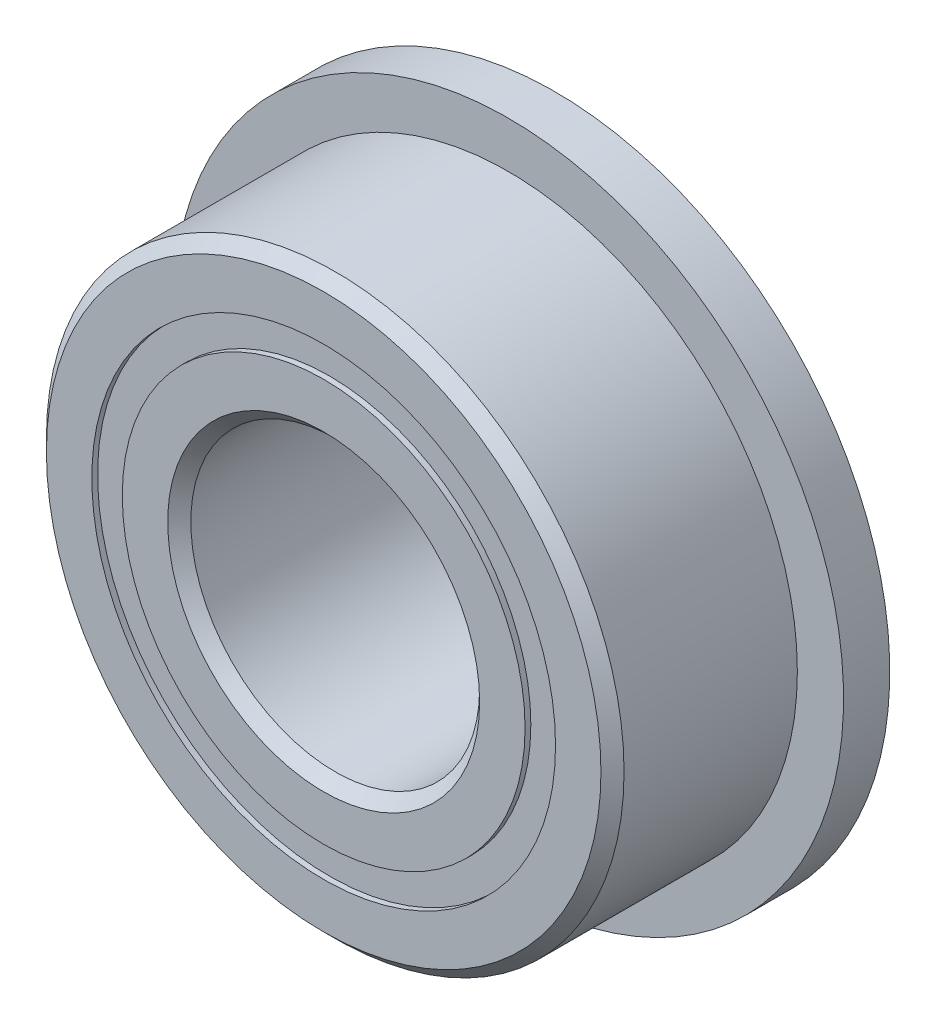
ISO-10303-21;
HEADER;
FILE_DESCRIPTION(('STEP AP214'),'2;1');
FILE_NAME('part.step','',(''),(''),'','','');
FILE_SCHEMA(('AUTOMOTIVE_DESIGN { 1 0 10303 214 1 1 1 1 }'));
ENDSEC;
DATA;
#1=APPLICATION_CONTEXT('core data for automotive mechanical design processes');
#2=APPLICATION_PROTOCOL_DEFINITION('international standard','automotive_design',2000,#1);
#3=PRODUCT_CONTEXT('',#1,'mechanical');
#4=PRODUCT('Part','Part','',(#3));
#5=PRODUCT_RELATED_PRODUCT_CATEGORY('part','',(#4));
#6=PRODUCT_DEFINITION_FORMATION('','',#4);
#7=PRODUCT_DEFINITION_CONTEXT('part definition',#1,'design');
#8=PRODUCT_DEFINITION('design','',#6,#7);
#9=PRODUCT_DEFINITION_SHAPE('','',#8);
#10=(LENGTH_UNIT() NAMED_UNIT(*) SI_UNIT(.MILLI.,.METRE.));
#11=(NAMED_UNIT(*) PLANE_ANGLE_UNIT() SI_UNIT($,.RADIAN.));
#12=(NAMED_UNIT(*) SI_UNIT($,.STERADIAN.) SOLID_ANGLE_UNIT());
#13=UNCERTAINTY_MEASURE_WITH_UNIT(LENGTH_MEASURE(1.E-05),#10,'distance_accuracy_value','');
#14=(GEOMETRIC_REPRESENTATION_CONTEXT(3) GLOBAL_UNCERTAINTY_ASSIGNED_CONTEXT((#13)) GLOBAL_UNIT_ASSIGNED_CONTEXT((#10,
#11,#12)) REPRESENTATION_CONTEXT('',''));
#15=CARTESIAN_POINT('',(0.,0.,0.));
#16=DIRECTION('',(0.,0.,1.));
#17=DIRECTION('',(1.,0.,0.));
#18=AXIS2_PLACEMENT_3D('',#15,#16,#17);
#19=CARTESIAN_POINT('',(0.,4.01373626373626,-1.9));
#20=DIRECTION('',(0.,0.,1.));
#21=DIRECTION('',(1.,0.,0.));
#22=AXIS2_PLACEMENT_3D('',#19,#20,#21);
#23=PLANE('',#22);
#24=CARTESIAN_POINT('',(0.,0.,-1.9));
#25=DIRECTION('',(0.,0.,1.));
#26=DIRECTION('',(1.,0.,0.));
#27=AXIS2_PLACEMENT_3D('',#24,#25,#26);
#28=CIRCLE('',#27,4.01373626373626);
#29=CARTESIAN_POINT('',(4.01373626373626,0.,-1.9));
#30=VERTEX_POINT('',#29);
#31=EDGE_CURVE('E55',#30,#30,#28,.T.);
#32=ORIENTED_EDGE('',*,*,#31,.F.);
#33=EDGE_LOOP('',(#32));
#34=FACE_BOUND('',#33,.T.);
#35=CARTESIAN_POINT('',(0.,0.,-1.9));
#36=DIRECTION('',(0.,0.,1.));
#37=DIRECTION('',(1.,0.,0.));
#38=AXIS2_PLACEMENT_3D('',#35,#36,#37);
#39=CIRCLE('',#38,3.48626373626374);
#40=CARTESIAN_POINT('',(3.48626373626374,0.,-1.9));
#41=VERTEX_POINT('',#40);
#42=EDGE_CURVE('E11',#41,#41,#39,.T.);
#43=ORIENTED_EDGE('',*,*,#42,.T.);
#44=EDGE_LOOP('',(#43));
#45=FACE_BOUND('',#44,.T.);
#46=ADVANCED_FACE('F41',(#34,#45),#23,.F.);
#47=CARTESIAN_POINT('',(0.,0.,2.));
#48=DIRECTION('',(0.,0.,1.));
#49=DIRECTION('',(1.,0.,0.));
#50=AXIS2_PLACEMENT_3D('',#47,#48,#49);
#51=CYLINDRICAL_SURFACE('',#50,3.48626373626374);
#52=ORIENTED_EDGE('',*,*,#42,.F.);
#53=EDGE_LOOP('',(#52));
#54=FACE_BOUND('',#53,.T.);
#55=CARTESIAN_POINT('',(0.,0.,-0.927189448602435));
#56=DIRECTION('',(0.,0.,1.));
#57=DIRECTION('',(1.,0.,0.));
#58=AXIS2_PLACEMENT_3D('',#55,#56,#57);
#59=CIRCLE('',#58,3.48626373626374);
#60=CARTESIAN_POINT('',(3.48626373626374,0.,-0.927189448602435));
#61=VERTEX_POINT('',#60);
#62=EDGE_CURVE('E47',#61,#61,#59,.T.);
#63=ORIENTED_EDGE('',*,*,#62,.T.);
#64=EDGE_LOOP('',(#63));
#65=FACE_BOUND('',#64,.T.);
#66=ADVANCED_FACE('F64',(#54,#65),#51,.F.);
#67=CARTESIAN_POINT('',(0.,4.01373626373626,-0.927189448602435));
#68=DIRECTION('',(0.,0.,-1.));
#69=DIRECTION('',(-1.,0.,0.));
#70=AXIS2_PLACEMENT_3D('',#67,#68,#69);
#71=PLANE('',#70);
#72=ORIENTED_EDGE('',*,*,#62,.F.);
#73=EDGE_LOOP('',(#72));
#74=FACE_BOUND('',#73,.T.);
#75=CARTESIAN_POINT('',(0.,0.,-0.927189448602435));
#76=DIRECTION('',(0.,0.,1.));
#77=DIRECTION('',(1.,0.,0.));
#78=AXIS2_PLACEMENT_3D('',#75,#76,#77);
#79=CIRCLE('',#78,4.01373626373626);
#80=CARTESIAN_POINT('',(4.01373626373626,0.,-0.927189448602435));
#81=VERTEX_POINT('',#80);
#82=EDGE_CURVE('E51',#81,#81,#79,.T.);
#83=ORIENTED_EDGE('',*,*,#82,.T.);
#84=EDGE_LOOP('',(#83));
#85=FACE_BOUND('',#84,.T.);
#86=ADVANCED_FACE('F68',(#74,#85),#71,.F.);
#87=CARTESIAN_POINT('',(0.,0.,2.));
#88=DIRECTION('',(0.,0.,1.));
#89=DIRECTION('',(1.,0.,0.));
#90=AXIS2_PLACEMENT_3D('',#87,#88,#89);
#91=CYLINDRICAL_SURFACE('',#90,4.01373626373626);
#92=ORIENTED_EDGE('',*,*,#82,.F.);
#93=EDGE_LOOP('',(#92));
#94=FACE_BOUND('',#93,.T.);
#95=ORIENTED_EDGE('',*,*,#31,.T.);
#96=EDGE_LOOP('',(#95));
#97=FACE_BOUND('',#96,.T.);
#98=ADVANCED_FACE('F61',(#94,#97),#91,.T.);
#99=CLOSED_SHELL('',(#46,#66,#86,#98));
#100=MANIFOLD_SOLID_BREP('B2',#99);
#101=CARTESIAN_POINT('',(0.,4.01373626373626,1.9));
#102=DIRECTION('',(0.,0.,-1.));
#103=DIRECTION('',(-1.,0.,0.));
#104=AXIS2_PLACEMENT_3D('',#101,#102,#103);
#105=PLANE('',#104);
#106=CARTESIAN_POINT('',(0.,0.,1.9));
#107=DIRECTION('',(0.,0.,1.));
#108=DIRECTION('',(1.,0.,0.));
#109=AXIS2_PLACEMENT_3D('',#106,#107,#108);
#110=CIRCLE('',#109,3.48626373626374);
#111=CARTESIAN_POINT('',(3.48626373626374,0.,1.9));
#112=VERTEX_POINT('',#111);
#113=EDGE_CURVE('E40',#112,#112,#110,.T.);
#114=ORIENTED_EDGE('',*,*,#113,.F.);
#115=EDGE_LOOP('',(#114));
#116=FACE_BOUND('',#115,.T.);
#117=CARTESIAN_POINT('',(0.,0.,1.9));
#118=DIRECTION('',(0.,0.,1.));
#119=DIRECTION('',(1.,0.,0.));
#120=AXIS2_PLACEMENT_3D('',#117,#118,#119);
#121=CIRCLE('',#120,4.01373626373626);
#122=CARTESIAN_POINT('',(4.01373626373626,0.,1.9));
#123=VERTEX_POINT('',#122);
#124=EDGE_CURVE('E122',#123,#123,#121,.T.);
#125=ORIENTED_EDGE('',*,*,#124,.T.);
#126=EDGE_LOOP('',(#125));
#127=FACE_BOUND('',#126,.T.);
#128=ADVANCED_FACE('F108',(#116,#127),#105,.F.);
#129=CARTESIAN_POINT('',(0.,0.,2.));
#130=DIRECTION('',(0.,0.,1.));
#131=DIRECTION('',(1.,0.,0.));
#132=AXIS2_PLACEMENT_3D('',#129,#130,#131);
#133=CYLINDRICAL_SURFACE('',#132,3.48626373626374);
#134=CARTESIAN_POINT('',(0.,0.,0.927189448602435));
#135=DIRECTION('',(0.,0.,1.));
#136=DIRECTION('',(1.,0.,0.));
#137=AXIS2_PLACEMENT_3D('',#134,#135,#136);
#138=CIRCLE('',#137,3.48626373626374);
#139=CARTESIAN_POINT('',(3.48626373626374,0.,0.927189448602435));
#140=VERTEX_POINT('',#139);
#141=EDGE_CURVE('E114',#140,#140,#138,.T.);
#142=ORIENTED_EDGE('',*,*,#141,.F.);
#143=EDGE_LOOP('',(#142));
#144=FACE_BOUND('',#143,.T.);
#145=ORIENTED_EDGE('',*,*,#113,.T.);
#146=EDGE_LOOP('',(#145));
#147=FACE_BOUND('',#146,.T.);
#148=ADVANCED_FACE('F137',(#144,#147),#133,.F.);
#149=CARTESIAN_POINT('',(0.,4.01373626373626,0.927189448602435));
#150=DIRECTION('',(0.,0.,1.));
#151=DIRECTION('',(1.,0.,0.));
#152=AXIS2_PLACEMENT_3D('',#149,#150,#151);
#153=PLANE('',#152);
#154=CARTESIAN_POINT('',(0.,0.,0.927189448602435));
#155=DIRECTION('',(0.,0.,1.));
#156=DIRECTION('',(1.,0.,0.));
#157=AXIS2_PLACEMENT_3D('',#154,#155,#156);
#158=CIRCLE('',#157,4.01373626373626);
#159=CARTESIAN_POINT('',(4.01373626373626,0.,0.927189448602435));
#160=VERTEX_POINT('',#159);
#161=EDGE_CURVE('E118',#160,#160,#158,.T.);
#162=ORIENTED_EDGE('',*,*,#161,.F.);
#163=EDGE_LOOP('',(#162));
#164=FACE_BOUND('',#163,.T.);
#165=ORIENTED_EDGE('',*,*,#141,.T.);
#166=EDGE_LOOP('',(#165));
#167=FACE_BOUND('',#166,.T.);
#168=ADVANCED_FACE('F132',(#164,#167),#153,.F.);
#169=CARTESIAN_POINT('',(0.,0.,2.));
#170=DIRECTION('',(0.,0.,1.));
#171=DIRECTION('',(1.,0.,0.));
#172=AXIS2_PLACEMENT_3D('',#169,#170,#171);
#173=CYLINDRICAL_SURFACE('',#172,4.01373626373626);
#174=ORIENTED_EDGE('',*,*,#124,.F.);
#175=EDGE_LOOP('',(#174));
#176=FACE_BOUND('',#175,.T.);
#177=ORIENTED_EDGE('',*,*,#161,.T.);
#178=EDGE_LOOP('',(#177));
#179=FACE_BOUND('',#178,.T.);
#180=ADVANCED_FACE('F129',(#176,#179),#173,.T.);
#181=CLOSED_SHELL('',(#128,#148,#168,#180));
#182=MANIFOLD_SOLID_BREP('B6',#181);
#183=CARTESIAN_POINT('',(-1.87499999999996,3.24759526419167,0.));
#184=DIRECTION('',(0.,0.,1.));
#185=DIRECTION('',(-0.499999999999989,0.866025403784445,0.));
#186=AXIS2_PLACEMENT_3D('',#183,#184,#185);
#187=SPHERICAL_SURFACE('',#186,0.927189448602435);
#188=CARTESIAN_POINT('',(-1.87499999999996,3.24759526419167,0.927189448602435));
#189=VERTEX_POINT('',#188);
#190=VERTEX_LOOP('',#189);
#191=FACE_BOUND('',#190,.T.);
#192=ADVANCED_FACE('F175',(#191),#187,.T.);
#193=CLOSED_SHELL('',(#192));
#194=MANIFOLD_SOLID_BREP('B35',#193);
#195=CARTESIAN_POINT('',(-3.24759526419162,1.87500000000004,0.));
#196=DIRECTION('',(0.,0.,1.));
#197=DIRECTION('',(-0.866025403784433,0.50000000000001,0.));
#198=AXIS2_PLACEMENT_3D('',#195,#196,#197);
#199=SPHERICAL_SURFACE('',#198,0.927189448602435);
#200=CARTESIAN_POINT('',(-3.24759526419162,1.87500000000004,0.927189448602435));
#201=VERTEX_POINT('',#200);
#202=VERTEX_LOOP('',#201);
#203=FACE_BOUND('',#202,.T.);
#204=ADVANCED_FACE('F195',(#203),#199,.T.);
#205=CLOSED_SHELL('',(#204));
#206=MANIFOLD_SOLID_BREP('B104',#205);
#207=CARTESIAN_POINT('',(-3.75,0.,0.));
#208=DIRECTION('',(0.,0.,1.));
#209=DIRECTION('',(-1.,0.,0.));
#210=AXIS2_PLACEMENT_3D('',#207,#208,#209);
#211=SPHERICAL_SURFACE('',#210,0.927189448602435);
#212=CARTESIAN_POINT('',(-3.75,0.,0.927189448602435));
#213=VERTEX_POINT('',#212);
#214=VERTEX_LOOP('',#213);
#215=FACE_BOUND('',#214,.T.);
#216=ADVANCED_FACE('F215',(#215),#211,.T.);
#217=CLOSED_SHELL('',(#216));
#218=MANIFOLD_SOLID_BREP('B171',#217);
#219=CARTESIAN_POINT('',(-3.24759526419166,-1.87499999999997,0.));
#220=DIRECTION('',(0.,0.,1.));
#221=DIRECTION('',(-0.866025403784443,-0.499999999999992,0.));
#222=AXIS2_PLACEMENT_3D('',#219,#220,#221);
#223=SPHERICAL_SURFACE('',#222,0.927189448602435);
#224=CARTESIAN_POINT('',(-3.24759526419166,-1.87499999999997,0.927189448602435));
#225=VERTEX_POINT('',#224);
#226=VERTEX_LOOP('',#225);
#227=FACE_BOUND('',#226,.T.);
#228=ADVANCED_FACE('F235',(#227),#223,.T.);
#229=CLOSED_SHELL('',(#228));
#230=MANIFOLD_SOLID_BREP('B191',#229);
#231=CARTESIAN_POINT('',(-1.87500000000003,-3.24759526419163,0.));
#232=DIRECTION('',(0.,0.,1.));
#233=DIRECTION('',(-0.500000000000007,-0.866025403784435,0.));
#234=AXIS2_PLACEMENT_3D('',#231,#232,#233);
#235=SPHERICAL_SURFACE('',#234,0.927189448602435);
#236=CARTESIAN_POINT('',(-1.87500000000003,-3.24759526419163,0.927189448602435));
#237=VERTEX_POINT('',#236);
#238=VERTEX_LOOP('',#237);
#239=FACE_BOUND('',#238,.T.);
#240=ADVANCED_FACE('F255',(#239),#235,.T.);
#241=CLOSED_SHELL('',(#240));
#242=MANIFOLD_SOLID_BREP('B211',#241);
#243=CARTESIAN_POINT('',(0.,-3.75,0.));
#244=DIRECTION('',(0.,0.,1.));
#245=DIRECTION('',(0.,-1.,0.));
#246=AXIS2_PLACEMENT_3D('',#243,#244,#245);
#247=SPHERICAL_SURFACE('',#246,0.927189448602435);
#248=CARTESIAN_POINT('',(0.,-3.75,0.927189448602435));
#249=VERTEX_POINT('',#248);
#250=VERTEX_LOOP('',#249);
#251=FACE_BOUND('',#250,.T.);
#252=ADVANCED_FACE('F275',(#251),#247,.T.);
#253=CLOSED_SHELL('',(#252));
#254=MANIFOLD_SOLID_BREP('B231',#253);
#255=CARTESIAN_POINT('',(1.87499999999998,-3.24759526419166,0.));
#256=DIRECTION('',(0.,0.,1.));
#257=DIRECTION('',(0.499999999999995,-0.866025403784442,0.));
#258=AXIS2_PLACEMENT_3D('',#255,#256,#257);
#259=SPHERICAL_SURFACE('',#258,0.927189448602435);
#260=CARTESIAN_POINT('',(1.87499999999998,-3.24759526419166,0.927189448602435));
#261=VERTEX_POINT('',#260);
#262=VERTEX_LOOP('',#261);
#263=FACE_BOUND('',#262,.T.);
#264=ADVANCED_FACE('F295',(#263),#259,.T.);
#265=CLOSED_SHELL('',(#264));
#266=MANIFOLD_SOLID_BREP('B251',#265);
#267=CARTESIAN_POINT('',(3.24759526419164,-1.87500000000002,0.));
#268=DIRECTION('',(0.,0.,1.));
#269=DIRECTION('',(0.866025403784436,-0.500000000000004,0.));
#270=AXIS2_PLACEMENT_3D('',#267,#268,#269);
#271=SPHERICAL_SURFACE('',#270,0.927189448602435);
#272=CARTESIAN_POINT('',(3.24759526419164,-1.87500000000002,0.927189448602435));
#273=VERTEX_POINT('',#272);
#274=VERTEX_LOOP('',#273);
#275=FACE_BOUND('',#274,.T.);
#276=ADVANCED_FACE('F315',(#275),#271,.T.);
#277=CLOSED_SHELL('',(#276));
#278=MANIFOLD_SOLID_BREP('B271',#277);
#279=CARTESIAN_POINT('',(3.75,0.,0.));
#280=DIRECTION('',(0.,0.,1.));
#281=DIRECTION('',(1.,0.,0.));
#282=AXIS2_PLACEMENT_3D('',#279,#280,#281);
#283=SPHERICAL_SURFACE('',#282,0.927189448602435);
#284=CARTESIAN_POINT('',(3.75,0.,0.927189448602435));
#285=VERTEX_POINT('',#284);
#286=VERTEX_LOOP('',#285);
#287=FACE_BOUND('',#286,.T.);
#288=ADVANCED_FACE('F335',(#287),#283,.T.);
#289=CLOSED_SHELL('',(#288));
#290=MANIFOLD_SOLID_BREP('B291',#289);
#291=CARTESIAN_POINT('',(3.24759526419165,1.87499999999999,0.));
#292=DIRECTION('',(0.,0.,1.));
#293=DIRECTION('',(0.86602540378444,0.499999999999998,0.));
#294=AXIS2_PLACEMENT_3D('',#291,#292,#293);
#295=SPHERICAL_SURFACE('',#294,0.927189448602435);
#296=CARTESIAN_POINT('',(3.24759526419165,1.87499999999999,0.927189448602435));
#297=VERTEX_POINT('',#296);
#298=VERTEX_LOOP('',#297);
#299=FACE_BOUND('',#298,.T.);
#300=ADVANCED_FACE('F355',(#299),#295,.T.);
#301=CLOSED_SHELL('',(#300));
#302=MANIFOLD_SOLID_BREP('B311',#301);
#303=CARTESIAN_POINT('',(1.875,3.24759526419164,0.));
#304=DIRECTION('',(0.,0.,1.));
#305=DIRECTION('',(0.500000000000001,0.866025403784438,0.));
#306=AXIS2_PLACEMENT_3D('',#303,#304,#305);
#307=SPHERICAL_SURFACE('',#306,0.927189448602435);
#308=CARTESIAN_POINT('',(1.875,3.24759526419164,0.927189448602435));
#309=VERTEX_POINT('',#308);
#310=VERTEX_LOOP('',#309);
#311=FACE_BOUND('',#310,.T.);
#312=ADVANCED_FACE('F375',(#311),#307,.T.);
#313=CLOSED_SHELL('',(#312));
#314=MANIFOLD_SOLID_BREP('B331',#313);
#315=CARTESIAN_POINT('',(0.,3.75,0.));
#316=DIRECTION('',(0.,0.,1.));
#317=DIRECTION('',(0.,1.,0.));
#318=AXIS2_PLACEMENT_3D('',#315,#316,#317);
#319=SPHERICAL_SURFACE('',#318,0.927189448602435);
#320=CARTESIAN_POINT('',(0.,3.75,0.927189448602435));
#321=VERTEX_POINT('',#320);
#322=VERTEX_LOOP('',#321);
#323=FACE_BOUND('',#322,.T.);
#324=ADVANCED_FACE('F397',(#323),#319,.T.);
#325=CLOSED_SHELL('',(#324));
#326=MANIFOLD_SOLID_BREP('B351',#325);
#327=CARTESIAN_POINT('',(0.,3.48626373626374,2.));
#328=DIRECTION('',(0.,0.,-1.));
#329=DIRECTION('',(-1.,0.,0.));
#330=AXIS2_PLACEMENT_3D('',#327,#328,#329);
#331=PLANE('',#330);
#332=CARTESIAN_POINT('',(0.,0.,2.));
#333=DIRECTION('',(0.,0.,1.));
#334=DIRECTION('',(1.,0.,0.));
#335=AXIS2_PLACEMENT_3D('',#332,#333,#334);
#336=CIRCLE('',#335,2.7);
#337=CARTESIAN_POINT('',(2.7,0.,2.));
#338=VERTEX_POINT('',#337);
#339=EDGE_CURVE('E444',#338,#338,#336,.T.);
#340=ORIENTED_EDGE('',*,*,#339,.F.);
#341=EDGE_LOOP('',(#340));
#342=FACE_BOUND('',#341,.T.);
#343=CARTESIAN_POINT('',(0.,0.,2.));
#344=DIRECTION('',(0.,0.,1.));
#345=DIRECTION('',(1.,0.,0.));
#346=AXIS2_PLACEMENT_3D('',#343,#344,#345);
#347=CIRCLE('',#346,3.48626373626374);
#348=CARTESIAN_POINT('',(3.48626373626374,0.,2.));
#349=VERTEX_POINT('',#348);
#350=EDGE_CURVE('E396',#349,#349,#347,.T.);
#351=ORIENTED_EDGE('',*,*,#350,.T.);
#352=EDGE_LOOP('',(#351));
#353=FACE_BOUND('',#352,.T.);
#354=ADVANCED_FACE('F416',(#342,#353),#331,.F.);
#355=CARTESIAN_POINT('',(0.,0.,2.));
#356=DIRECTION('',(0.,0.,1.));
#357=DIRECTION('',(1.,0.,0.));
#358=AXIS2_PLACEMENT_3D('',#355,#356,#357);
#359=CYLINDRICAL_SURFACE('',#358,3.48626373626374);
#360=ORIENTED_EDGE('',*,*,#350,.F.);
#361=EDGE_LOOP('',(#360));
#362=FACE_BOUND('',#361,.T.);
#363=CARTESIAN_POINT('',(0.,0.,0.888888888888889));
#364=DIRECTION('',(0.,0.,1.));
#365=DIRECTION('',(1.,0.,0.));
#366=AXIS2_PLACEMENT_3D('',#363,#364,#365);
#367=CIRCLE('',#366,3.48626373626374);
#368=CARTESIAN_POINT('',(3.48626373626374,0.,0.888888888888889));
#369=VERTEX_POINT('',#368);
#370=EDGE_CURVE('E422',#369,#369,#367,.T.);
#371=ORIENTED_EDGE('',*,*,#370,.T.);
#372=EDGE_LOOP('',(#371));
#373=FACE_BOUND('',#372,.T.);
#374=ADVANCED_FACE('F451',(#362,#373),#359,.T.);
#375=CARTESIAN_POINT('',(0.,0.,0.));
#376=DIRECTION('',(0.,0.,1.));
#377=DIRECTION('',(1.,0.,0.));
#378=AXIS2_PLACEMENT_3D('',#375,#376,#377);
#379=TOROIDAL_SURFACE('',#378,3.75,0.927189448602434);
#380=ORIENTED_EDGE('',*,*,#370,.F.);
#381=EDGE_LOOP('',(#380));
#382=FACE_BOUND('',#381,.T.);
#383=CARTESIAN_POINT('',(0.,0.,-0.88888888888889));
#384=DIRECTION('',(0.,0.,1.));
#385=DIRECTION('',(1.,0.,0.));
#386=AXIS2_PLACEMENT_3D('',#383,#384,#385);
#387=CIRCLE('',#386,3.48626373626374);
#388=CARTESIAN_POINT('',(3.48626373626374,0.,-0.88888888888889));
#389=VERTEX_POINT('',#388);
#390=EDGE_CURVE('E426',#389,#389,#387,.T.);
#391=ORIENTED_EDGE('',*,*,#390,.T.);
#392=EDGE_LOOP('',(#391));
#393=FACE_BOUND('',#392,.T.);
#394=ADVANCED_FACE('F455',(#382,#393),#379,.F.);
#395=CARTESIAN_POINT('',(0.,0.,2.));
#396=DIRECTION('',(0.,0.,1.));
#397=DIRECTION('',(1.,0.,0.));
#398=AXIS2_PLACEMENT_3D('',#395,#396,#397);
#399=CYLINDRICAL_SURFACE('',#398,3.48626373626374);
#400=ORIENTED_EDGE('',*,*,#390,.F.);
#401=EDGE_LOOP('',(#400));
#402=FACE_BOUND('',#401,.T.);
#403=CARTESIAN_POINT('',(0.,0.,-2.));
#404=DIRECTION('',(0.,0.,1.));
#405=DIRECTION('',(1.,0.,0.));
#406=AXIS2_PLACEMENT_3D('',#403,#404,#405);
#407=CIRCLE('',#406,3.48626373626374);
#408=CARTESIAN_POINT('',(3.48626373626374,0.,-2.));
#409=VERTEX_POINT('',#408);
#410=EDGE_CURVE('E430',#409,#409,#407,.T.);
#411=ORIENTED_EDGE('',*,*,#410,.T.);
#412=EDGE_LOOP('',(#411));
#413=FACE_BOUND('',#412,.T.);
#414=ADVANCED_FACE('F460',(#402,#413),#399,.T.);
#415=CARTESIAN_POINT('',(0.,2.7,-2.));
#416=DIRECTION('',(0.,0.,1.));
#417=DIRECTION('',(1.,0.,0.));
#418=AXIS2_PLACEMENT_3D('',#415,#416,#417);
#419=PLANE('',#418);
#420=ORIENTED_EDGE('',*,*,#410,.F.);
#421=EDGE_LOOP('',(#420));
#422=FACE_BOUND('',#421,.T.);
#423=CARTESIAN_POINT('',(0.,0.,-2.));
#424=DIRECTION('',(0.,0.,1.));
#425=DIRECTION('',(1.,0.,0.));
#426=AXIS2_PLACEMENT_3D('',#423,#424,#425);
#427=CIRCLE('',#426,2.7);
#428=CARTESIAN_POINT('',(2.7,0.,-2.));
#429=VERTEX_POINT('',#428);
#430=EDGE_CURVE('E435',#429,#429,#427,.T.);
#431=ORIENTED_EDGE('',*,*,#430,.T.);
#432=EDGE_LOOP('',(#431));
#433=FACE_BOUND('',#432,.T.);
#434=ADVANCED_FACE('F466',(#422,#433),#419,.F.);
#435=CARTESIAN_POINT('',(0.,0.,-1.8));
#436=DIRECTION('',(0.,0.,-1.));
#437=DIRECTION('',(-1.,0.,0.));
#438=AXIS2_PLACEMENT_3D('',#435,#436,#437);
#439=CONICAL_SURFACE('',#438,2.5,0.785398163397449);
#440=ORIENTED_EDGE('',*,*,#430,.F.);
#441=EDGE_LOOP('',(#440));
#442=FACE_BOUND('',#441,.T.);
#443=CARTESIAN_POINT('',(0.,0.,-1.8));
#444=DIRECTION('',(0.,0.,1.));
#445=DIRECTION('',(1.,0.,0.));
#446=AXIS2_PLACEMENT_3D('',#443,#444,#445);
#447=CIRCLE('',#446,2.5);
#448=CARTESIAN_POINT('',(2.5,0.,-1.8));
#449=VERTEX_POINT('',#448);
#450=EDGE_CURVE('E438',#449,#449,#447,.T.);
#451=ORIENTED_EDGE('',*,*,#450,.T.);
#452=EDGE_LOOP('',(#451));
#453=FACE_BOUND('',#452,.T.);
#454=ADVANCED_FACE('F470',(#442,#453),#439,.F.);
#455=CARTESIAN_POINT('',(0.,0.,2.));
#456=DIRECTION('',(0.,0.,1.));
#457=DIRECTION('',(1.,0.,0.));
#458=AXIS2_PLACEMENT_3D('',#455,#456,#457);
#459=CYLINDRICAL_SURFACE('',#458,2.5);
#460=ORIENTED_EDGE('',*,*,#450,.F.);
#461=EDGE_LOOP('',(#460));
#462=FACE_BOUND('',#461,.T.);
#463=CARTESIAN_POINT('',(0.,0.,1.8));
#464=DIRECTION('',(0.,0.,1.));
#465=DIRECTION('',(1.,0.,0.));
#466=AXIS2_PLACEMENT_3D('',#463,#464,#465);
#467=CIRCLE('',#466,2.5);
#468=CARTESIAN_POINT('',(2.5,0.,1.8));
#469=VERTEX_POINT('',#468);
#470=EDGE_CURVE('E441',#469,#469,#467,.T.);
#471=ORIENTED_EDGE('',*,*,#470,.T.);
#472=EDGE_LOOP('',(#471));
#473=FACE_BOUND('',#472,.T.);
#474=ADVANCED_FACE('F474',(#462,#473),#459,.F.);
#475=CARTESIAN_POINT('',(0.,0.,2.));
#476=DIRECTION('',(0.,0.,1.));
#477=DIRECTION('',(1.,0.,0.));
#478=AXIS2_PLACEMENT_3D('',#475,#476,#477);
#479=CONICAL_SURFACE('',#478,2.7,0.785398163397447);
#480=ORIENTED_EDGE('',*,*,#470,.F.);
#481=EDGE_LOOP('',(#480));
#482=FACE_BOUND('',#481,.T.);
#483=ORIENTED_EDGE('',*,*,#339,.T.);
#484=EDGE_LOOP('',(#483));
#485=FACE_BOUND('',#484,.T.);
#486=ADVANCED_FACE('F448',(#482,#485),#479,.F.);
#487=CLOSED_SHELL('',(#354,#374,#394,#414,#434,#454,#474,#486));
#488=MANIFOLD_SOLID_BREP('B371',#487);
#489=CARTESIAN_POINT('',(0.,0.,1.8));
#490=DIRECTION('',(0.,0.,-1.));
#491=DIRECTION('',(-1.,0.,0.));
#492=AXIS2_PLACEMENT_3D('',#489,#490,#491);
#493=CONICAL_SURFACE('',#492,5.,0.785398163397447);
#494=CARTESIAN_POINT('',(0.,0.,2.));
#495=DIRECTION('',(0.,0.,1.));
#496=DIRECTION('',(1.,0.,0.));
#497=AXIS2_PLACEMENT_3D('',#494,#495,#496);
#498=CIRCLE('',#497,4.8);
#499=CARTESIAN_POINT('',(4.8,0.,2.));
#500=VERTEX_POINT('',#499);
#501=EDGE_CURVE('E559',#500,#500,#498,.T.);
#502=ORIENTED_EDGE('',*,*,#501,.F.);
#503=EDGE_LOOP('',(#502));
#504=FACE_BOUND('',#503,.T.);
#505=CARTESIAN_POINT('',(0.,0.,1.8));
#506=DIRECTION('',(0.,0.,1.));
#507=DIRECTION('',(1.,0.,0.));
#508=AXIS2_PLACEMENT_3D('',#505,#506,#507);
#509=CIRCLE('',#508,5.);
#510=CARTESIAN_POINT('',(5.,0.,1.8));
#511=VERTEX_POINT('',#510);
#512=EDGE_CURVE('E415',#511,#511,#509,.T.);
#513=ORIENTED_EDGE('',*,*,#512,.T.);
#514=EDGE_LOOP('',(#513));
#515=FACE_BOUND('',#514,.T.);
#516=ADVANCED_FACE('F537',(#504,#515),#493,.T.);
#517=CARTESIAN_POINT('',(0.,0.,2.));
#518=DIRECTION('',(0.,0.,1.));
#519=DIRECTION('',(1.,0.,0.));
#520=AXIS2_PLACEMENT_3D('',#517,#518,#519);
#521=CYLINDRICAL_SURFACE('',#520,5.);
#522=CARTESIAN_POINT('',(0.,0.,-1.2));
#523=DIRECTION('',(0.,0.,1.));
#524=DIRECTION('',(1.,0.,0.));
#525=AXIS2_PLACEMENT_3D('',#522,#523,#524);
#526=CIRCLE('',#525,5.);
#527=CARTESIAN_POINT('',(5.,0.,-1.2));
#528=VERTEX_POINT('',#527);
#529=EDGE_CURVE('E562',#528,#528,#526,.T.);
#530=ORIENTED_EDGE('',*,*,#529,.T.);
#531=EDGE_LOOP('',(#530));
#532=FACE_BOUND('',#531,.T.);
#533=ORIENTED_EDGE('',*,*,#512,.F.);
#534=EDGE_LOOP('',(#533));
#535=FACE_BOUND('',#534,.T.);
#536=ADVANCED_FACE('F582',(#532,#535),#521,.T.);
#537=CARTESIAN_POINT('',(0.,4.8,-2.));
#538=DIRECTION('',(0.,0.,1.));
#539=DIRECTION('',(1.,0.,0.));
#540=AXIS2_PLACEMENT_3D('',#537,#538,#539);
#541=PLANE('',#540);
#542=CARTESIAN_POINT('',(0.,0.,-2.));
#543=DIRECTION('',(0.,0.,1.));
#544=DIRECTION('',(1.,0.,0.));
#545=AXIS2_PLACEMENT_3D('',#542,#543,#544);
#546=CIRCLE('',#545,4.01373626373626);
#547=CARTESIAN_POINT('',(4.01373626373626,0.,-2.));
#548=VERTEX_POINT('',#547);
#549=EDGE_CURVE('E543',#548,#548,#546,.T.);
#550=ORIENTED_EDGE('',*,*,#549,.T.);
#551=EDGE_LOOP('',(#550));
#552=FACE_BOUND('',#551,.T.);
#553=CARTESIAN_POINT('',(0.,0.,-2.));
#554=DIRECTION('',(0.,0.,-1.));
#555=DIRECTION('',(-1.,0.,0.));
#556=AXIS2_PLACEMENT_3D('',#553,#554,#555);
#557=CIRCLE('',#556,5.8);
#558=CARTESIAN_POINT('',(-5.8,0.,-2.));
#559=VERTEX_POINT('',#558);
#560=EDGE_CURVE('E565',#559,#559,#557,.T.);
#561=ORIENTED_EDGE('',*,*,#560,.T.);
#562=EDGE_LOOP('',(#561));
#563=FACE_BOUND('',#562,.T.);
#564=ADVANCED_FACE('F585',(#552,#563),#541,.F.);
#565=CARTESIAN_POINT('',(0.,0.,2.));
#566=DIRECTION('',(0.,0.,1.));
#567=DIRECTION('',(1.,0.,0.));
#568=AXIS2_PLACEMENT_3D('',#565,#566,#567);
#569=CYLINDRICAL_SURFACE('',#568,4.01373626373626);
#570=CARTESIAN_POINT('',(0.,0.,-0.888888888888889));
#571=DIRECTION('',(0.,0.,1.));
#572=DIRECTION('',(1.,0.,0.));
#573=AXIS2_PLACEMENT_3D('',#570,#571,#572);
#574=CIRCLE('',#573,4.01373626373626);
#575=CARTESIAN_POINT('',(4.01373626373626,0.,-0.888888888888889));
#576=VERTEX_POINT('',#575);
#577=EDGE_CURVE('E547',#576,#576,#574,.T.);
#578=ORIENTED_EDGE('',*,*,#577,.T.);
#579=EDGE_LOOP('',(#578));
#580=FACE_BOUND('',#579,.T.);
#581=ORIENTED_EDGE('',*,*,#549,.F.);
#582=EDGE_LOOP('',(#581));
#583=FACE_BOUND('',#582,.T.);
#584=ADVANCED_FACE('F590',(#580,#583),#569,.F.);
#585=CARTESIAN_POINT('',(0.,0.,0.));
#586=DIRECTION('',(0.,0.,1.));
#587=DIRECTION('',(1.,0.,0.));
#588=AXIS2_PLACEMENT_3D('',#585,#586,#587);
#589=TOROIDAL_SURFACE('',#588,3.75,0.927189448602435);
#590=ORIENTED_EDGE('',*,*,#577,.F.);
#591=EDGE_LOOP('',(#590));
#592=FACE_BOUND('',#591,.T.);
#593=CARTESIAN_POINT('',(0.,0.,0.888888888888889));
#594=DIRECTION('',(0.,0.,1.));
#595=DIRECTION('',(1.,0.,0.));
#596=AXIS2_PLACEMENT_3D('',#593,#594,#595);
#597=CIRCLE('',#596,4.01373626373626);
#598=CARTESIAN_POINT('',(4.01373626373626,0.,0.888888888888889));
#599=VERTEX_POINT('',#598);
#600=EDGE_CURVE('E551',#599,#599,#597,.T.);
#601=ORIENTED_EDGE('',*,*,#600,.T.);
#602=EDGE_LOOP('',(#601));
#603=FACE_BOUND('',#602,.T.);
#604=ADVANCED_FACE('F596',(#592,#603),#589,.F.);
#605=CARTESIAN_POINT('',(0.,0.,2.));
#606=DIRECTION('',(0.,0.,1.));
#607=DIRECTION('',(1.,0.,0.));
#608=AXIS2_PLACEMENT_3D('',#605,#606,#607);
#609=CYLINDRICAL_SURFACE('',#608,4.01373626373626);
#610=ORIENTED_EDGE('',*,*,#600,.F.);
#611=EDGE_LOOP('',(#610));
#612=FACE_BOUND('',#611,.T.);
#613=CARTESIAN_POINT('',(0.,0.,2.));
#614=DIRECTION('',(0.,0.,1.));
#615=DIRECTION('',(1.,0.,0.));
#616=AXIS2_PLACEMENT_3D('',#613,#614,#615);
#617=CIRCLE('',#616,4.01373626373626);
#618=CARTESIAN_POINT('',(4.01373626373626,0.,2.));
#619=VERTEX_POINT('',#618);
#620=EDGE_CURVE('E556',#619,#619,#617,.T.);
#621=ORIENTED_EDGE('',*,*,#620,.T.);
#622=EDGE_LOOP('',(#621));
#623=FACE_BOUND('',#622,.T.);
#624=ADVANCED_FACE('F600',(#612,#623),#609,.F.);
#625=CARTESIAN_POINT('',(0.,4.8,2.));
#626=DIRECTION('',(0.,0.,-1.));
#627=DIRECTION('',(-1.,0.,0.));
#628=AXIS2_PLACEMENT_3D('',#625,#626,#627);
#629=PLANE('',#628);
#630=ORIENTED_EDGE('',*,*,#620,.F.);
#631=EDGE_LOOP('',(#630));
#632=FACE_BOUND('',#631,.T.);
#633=ORIENTED_EDGE('',*,*,#501,.T.);
#634=EDGE_LOOP('',(#633));
#635=FACE_BOUND('',#634,.T.);
#636=ADVANCED_FACE('F578',(#632,#635),#629,.F.);
#637=CARTESIAN_POINT('',(0.,4.01373626373626,-1.2));
#638=DIRECTION('',(0.,0.,1.));
#639=DIRECTION('',(1.,0.,0.));
#640=AXIS2_PLACEMENT_3D('',#637,#638,#639);
#641=PLANE('',#640);
#642=CARTESIAN_POINT('',(0.,0.,-1.2));
#643=DIRECTION('',(0.,0.,-1.));
#644=DIRECTION('',(-1.,0.,0.));
#645=AXIS2_PLACEMENT_3D('',#642,#643,#644);
#646=CIRCLE('',#645,5.8);
#647=CARTESIAN_POINT('',(-5.8,0.,-1.2));
#648=VERTEX_POINT('',#647);
#649=EDGE_CURVE('E568',#648,#648,#646,.T.);
#650=ORIENTED_EDGE('',*,*,#649,.F.);
#651=EDGE_LOOP('',(#650));
#652=FACE_BOUND('',#651,.T.);
#653=ORIENTED_EDGE('',*,*,#529,.F.);
#654=EDGE_LOOP('',(#653));
#655=FACE_BOUND('',#654,.T.);
#656=ADVANCED_FACE('F575',(#652,#655),#641,.T.);
#657=CARTESIAN_POINT('',(0.,0.,-2.));
#658=DIRECTION('',(0.,0.,-1.));
#659=DIRECTION('',(-1.,0.,0.));
#660=AXIS2_PLACEMENT_3D('',#657,#658,#659);
#661=CYLINDRICAL_SURFACE('',#660,5.8);
#662=ORIENTED_EDGE('',*,*,#649,.T.);
#663=EDGE_LOOP('',(#662));
#664=FACE_BOUND('',#663,.T.);
#665=ORIENTED_EDGE('',*,*,#560,.F.);
#666=EDGE_LOOP('',(#665));
#667=FACE_BOUND('',#666,.T.);
#668=ADVANCED_FACE('F572',(#664,#667),#661,.T.);
#669=CLOSED_SHELL('',(#516,#536,#564,#584,#604,#624,#636,#656,#668));
#670=MANIFOLD_SOLID_BREP('B391',#669);
#671=ADVANCED_BREP_SHAPE_REPRESENTATION('',(#18,#100,#182,#194,#206,#218,#230,#242,#254,#266,
#278,#290,#302,#314,#326,#488,#670),#14);
#672=SHAPE_DEFINITION_REPRESENTATION(#9,#671);
ENDSEC;
END-ISO-10303-21;
